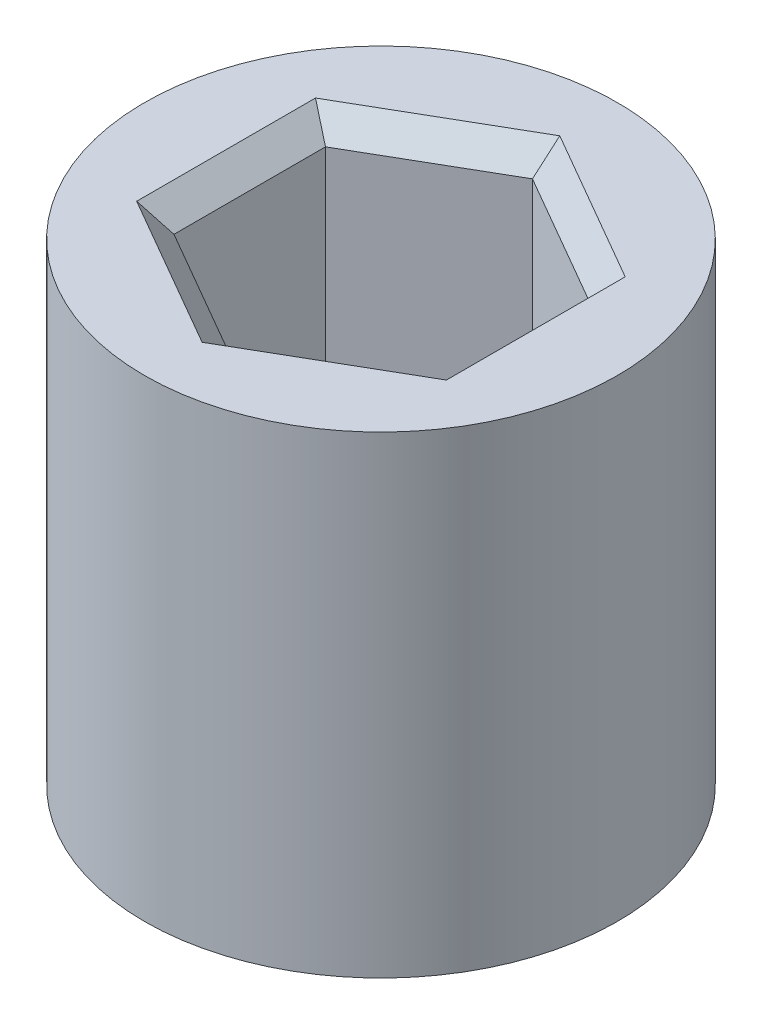
ISO-10303-21;
HEADER;
FILE_DESCRIPTION(('STEP AP214'),'2;1');
FILE_NAME('part.step','',(''),(''),'','','');
FILE_SCHEMA(('AUTOMOTIVE_DESIGN { 1 0 10303 214 1 1 1 1 }'));
ENDSEC;
DATA;
#1=APPLICATION_CONTEXT('core data for automotive mechanical design processes');
#2=APPLICATION_PROTOCOL_DEFINITION('international standard','automotive_design',2000,#1);
#3=PRODUCT_CONTEXT('',#1,'mechanical');
#4=PRODUCT('Part','Part','',(#3));
#5=PRODUCT_RELATED_PRODUCT_CATEGORY('part','',(#4));
#6=PRODUCT_DEFINITION_FORMATION('','',#4);
#7=PRODUCT_DEFINITION_CONTEXT('part definition',#1,'design');
#8=PRODUCT_DEFINITION('design','',#6,#7);
#9=PRODUCT_DEFINITION_SHAPE('','',#8);
#10=(LENGTH_UNIT() NAMED_UNIT(*) SI_UNIT(.MILLI.,.METRE.));
#11=(NAMED_UNIT(*) PLANE_ANGLE_UNIT() SI_UNIT($,.RADIAN.));
#12=(NAMED_UNIT(*) SI_UNIT($,.STERADIAN.) SOLID_ANGLE_UNIT());
#13=UNCERTAINTY_MEASURE_WITH_UNIT(LENGTH_MEASURE(1.E-05),#10,'distance_accuracy_value','');
#14=(GEOMETRIC_REPRESENTATION_CONTEXT(3) GLOBAL_UNCERTAINTY_ASSIGNED_CONTEXT((#13)) GLOBAL_UNIT_ASSIGNED_CONTEXT((#10,
#11,#12)) REPRESENTATION_CONTEXT('',''));
#15=CARTESIAN_POINT('',(0.,0.,0.));
#16=DIRECTION('',(0.,0.,1.));
#17=DIRECTION('',(1.,0.,0.));
#18=AXIS2_PLACEMENT_3D('',#15,#16,#17);
#19=CARTESIAN_POINT('',(0.,10.,0.));
#20=DIRECTION('',(0.,-1.,0.));
#21=DIRECTION('',(0.,0.,-1.));
#22=AXIS2_PLACEMENT_3D('',#19,#20,#21);
#23=CYLINDRICAL_SURFACE('',#22,5.);
#24=CARTESIAN_POINT('',(0.,10.,0.));
#25=DIRECTION('',(0.,1.,0.));
#26=DIRECTION('',(0.,0.,1.));
#27=AXIS2_PLACEMENT_3D('',#24,#25,#26);
#28=CIRCLE('',#27,5.);
#29=CARTESIAN_POINT('',(0.,10.,5.));
#30=VERTEX_POINT('',#29);
#31=EDGE_CURVE('E180',#30,#30,#28,.T.);
#32=ORIENTED_EDGE('',*,*,#31,.F.);
#33=EDGE_LOOP('',(#32));
#34=FACE_BOUND('',#33,.T.);
#35=CARTESIAN_POINT('',(0.,0.,0.));
#36=DIRECTION('',(0.,1.,0.));
#37=DIRECTION('',(0.,0.,1.));
#38=AXIS2_PLACEMENT_3D('',#35,#36,#37);
#39=CIRCLE('',#38,5.);
#40=CARTESIAN_POINT('',(0.,0.,5.));
#41=VERTEX_POINT('',#40);
#42=EDGE_CURVE('E166',#41,#41,#39,.T.);
#43=ORIENTED_EDGE('',*,*,#42,.T.);
#44=EDGE_LOOP('',(#43));
#45=FACE_BOUND('',#44,.T.);
#46=ADVANCED_FACE('F49',(#34,#45),#23,.T.);
#47=CARTESIAN_POINT('',(0.,10.,0.));
#48=DIRECTION('',(0.,1.,0.));
#49=DIRECTION('',(0.,0.,1.));
#50=AXIS2_PLACEMENT_3D('',#47,#48,#49);
#51=PLANE('',#50);
#52=DIRECTION('',(0.,0.,1.));
#53=VECTOR('',#52,1.);
#54=CARTESIAN_POINT('',(3.275,10.,1.60214699700121));
#55=LINE('',#54,#53);
#56=CARTESIAN_POINT('',(3.275,10.,-1.89082213159603));
#57=VERTEX_POINT('',#56);
#58=CARTESIAN_POINT('',(3.275,10.,1.89082213159602));
#59=VERTEX_POINT('',#58);
#60=EDGE_CURVE('E203',#57,#59,#55,.T.);
#61=ORIENTED_EDGE('',*,*,#60,.T.);
#62=DIRECTION('',(-0.866025403784439,0.,0.5));
#63=VECTOR('',#62,1.);
#64=CARTESIAN_POINT('',(0.250000000000001,10.,3.63730669589464));
#65=LINE('',#64,#63);
#66=CARTESIAN_POINT('',(0.,10.,3.78164426319205));
#67=VERTEX_POINT('',#66);
#68=EDGE_CURVE('E206',#59,#67,#65,.T.);
#69=ORIENTED_EDGE('',*,*,#68,.T.);
#70=DIRECTION('',(-0.866025403784439,0.,-0.5));
#71=VECTOR('',#70,1.);
#72=CARTESIAN_POINT('',(-3.025,10.,2.03515969889343));
#73=LINE('',#72,#71);
#74=CARTESIAN_POINT('',(-3.275,10.,1.89082213159603));
#75=VERTEX_POINT('',#74);
#76=EDGE_CURVE('E194',#67,#75,#73,.T.);
#77=ORIENTED_EDGE('',*,*,#76,.T.);
#78=DIRECTION('',(0.,0.,-1.));
#79=VECTOR('',#78,1.);
#80=CARTESIAN_POINT('',(-3.275,10.,-1.60214699700121));
#81=LINE('',#80,#79);
#82=CARTESIAN_POINT('',(-3.275,10.,-1.89082213159602));
#83=VERTEX_POINT('',#82);
#84=EDGE_CURVE('E191',#75,#83,#81,.T.);
#85=ORIENTED_EDGE('',*,*,#84,.T.);
#86=DIRECTION('',(0.866025403784439,0.,-0.5));
#87=VECTOR('',#86,1.);
#88=CARTESIAN_POINT('',(-0.250000000000001,10.,-3.63730669589464));
#89=LINE('',#88,#87);
#90=CARTESIAN_POINT('',(0.,10.,-3.78164426319205));
#91=VERTEX_POINT('',#90);
#92=EDGE_CURVE('E197',#83,#91,#89,.T.);
#93=ORIENTED_EDGE('',*,*,#92,.T.);
#94=DIRECTION('',(0.866025403784439,0.,0.5));
#95=VECTOR('',#94,1.);
#96=CARTESIAN_POINT('',(3.025,10.,-2.03515969889343));
#97=LINE('',#96,#95);
#98=EDGE_CURVE('E200',#91,#57,#97,.T.);
#99=ORIENTED_EDGE('',*,*,#98,.T.);
#100=EDGE_LOOP('',(#61,#69,#77,#85,#93,#99));
#101=FACE_BOUND('',#100,.T.);
#102=ORIENTED_EDGE('',*,*,#31,.T.);
#103=EDGE_LOOP('',(#102));
#104=FACE_BOUND('',#103,.T.);
#105=ADVANCED_FACE('F274',(#101,#104),#51,.T.);
#106=CARTESIAN_POINT('',(0.,0.,0.));
#107=DIRECTION('',(0.,1.,0.));
#108=DIRECTION('',(0.,0.,1.));
#109=AXIS2_PLACEMENT_3D('',#106,#107,#108);
#110=PLANE('',#109);
#111=ORIENTED_EDGE('',*,*,#42,.F.);
#112=EDGE_LOOP('',(#111));
#113=FACE_BOUND('',#112,.T.);
#114=ADVANCED_FACE('F270',(#113),#110,.F.);
#115=CARTESIAN_POINT('',(-2.775,3.4,-1.60214699700121));
#116=DIRECTION('',(-1.,0.,0.));
#117=DIRECTION('',(0.,0.,1.));
#118=AXIS2_PLACEMENT_3D('',#115,#116,#117);
#119=PLANE('',#118);
#120=DIRECTION('',(0.,1.,0.));
#121=VECTOR('',#120,1.);
#122=CARTESIAN_POINT('',(-2.775,3.4,-1.60214699700121));
#123=LINE('',#122,#121);
#124=CARTESIAN_POINT('',(-2.775,3.4,-1.60214699700121));
#125=VERTEX_POINT('',#124);
#126=CARTESIAN_POINT('',(-2.775,9.5,-1.60214699700121));
#127=VERTEX_POINT('',#126);
#128=EDGE_CURVE('E163',#125,#127,#123,.T.);
#129=ORIENTED_EDGE('',*,*,#128,.T.);
#130=DIRECTION('',(0.,0.,1.));
#131=VECTOR('',#130,1.);
#132=CARTESIAN_POINT('',(-2.775,9.5,1.60214699700121));
#133=LINE('',#132,#131);
#134=CARTESIAN_POINT('',(-2.775,9.5,1.60214699700121));
#135=VERTEX_POINT('',#134);
#136=EDGE_CURVE('E11',#127,#135,#133,.T.);
#137=ORIENTED_EDGE('',*,*,#136,.T.);
#138=DIRECTION('',(0.,1.,0.));
#139=VECTOR('',#138,1.);
#140=CARTESIAN_POINT('',(-2.775,3.4,1.60214699700121));
#141=LINE('',#140,#139);
#142=CARTESIAN_POINT('',(-2.775,3.4,1.60214699700121));
#143=VERTEX_POINT('',#142);
#144=EDGE_CURVE('E121',#143,#135,#141,.T.);
#145=ORIENTED_EDGE('',*,*,#144,.F.);
#146=DIRECTION('',(0.,0.,1.));
#147=VECTOR('',#146,1.);
#148=CARTESIAN_POINT('',(-2.775,3.4,-1.60214699700121));
#149=LINE('',#148,#147);
#150=EDGE_CURVE('E125',#125,#143,#149,.T.);
#151=ORIENTED_EDGE('',*,*,#150,.F.);
#152=EDGE_LOOP('',(#129,#137,#145,#151));
#153=FACE_BOUND('',#152,.T.);
#154=ADVANCED_FACE('F123',(#153),#119,.F.);
#155=CARTESIAN_POINT('',(0.,3.4,-3.20429399400242));
#156=DIRECTION('',(-0.5,0.,-0.866025403784438));
#157=DIRECTION('',(-0.866025403784439,0.,0.5));
#158=AXIS2_PLACEMENT_3D('',#155,#156,#157);
#159=PLANE('',#158);
#160=DIRECTION('',(0.,1.,0.));
#161=VECTOR('',#160,1.);
#162=CARTESIAN_POINT('',(0.,3.4,-3.20429399400242));
#163=LINE('',#162,#161);
#164=CARTESIAN_POINT('',(0.,3.4,-3.20429399400242));
#165=VERTEX_POINT('',#164);
#166=CARTESIAN_POINT('',(0.,9.5,-3.20429399400242));
#167=VERTEX_POINT('',#166);
#168=EDGE_CURVE('E167',#165,#167,#163,.T.);
#169=ORIENTED_EDGE('',*,*,#168,.T.);
#170=DIRECTION('',(-0.866025403784439,0.,0.5));
#171=VECTOR('',#170,1.);
#172=CARTESIAN_POINT('',(-2.775,9.5,-1.60214699700121));
#173=LINE('',#172,#171);
#174=EDGE_CURVE('E74',#167,#127,#173,.T.);
#175=ORIENTED_EDGE('',*,*,#174,.T.);
#176=ORIENTED_EDGE('',*,*,#128,.F.);
#177=DIRECTION('',(-0.866025403784439,0.,0.5));
#178=VECTOR('',#177,1.);
#179=CARTESIAN_POINT('',(0.,3.4,-3.20429399400242));
#180=LINE('',#179,#178);
#181=EDGE_CURVE('E131',#165,#125,#180,.T.);
#182=ORIENTED_EDGE('',*,*,#181,.F.);
#183=EDGE_LOOP('',(#169,#175,#176,#182));
#184=FACE_BOUND('',#183,.T.);
#185=ADVANCED_FACE('F262',(#184),#159,.F.);
#186=CARTESIAN_POINT('',(2.775,3.4,-1.60214699700121));
#187=DIRECTION('',(0.5,0.,-0.866025403784439));
#188=DIRECTION('',(-0.866025403784438,0.,-0.5));
#189=AXIS2_PLACEMENT_3D('',#186,#187,#188);
#190=PLANE('',#189);
#191=DIRECTION('',(0.,1.,0.));
#192=VECTOR('',#191,1.);
#193=CARTESIAN_POINT('',(2.775,3.4,-1.60214699700121));
#194=LINE('',#193,#192);
#195=CARTESIAN_POINT('',(2.775,3.4,-1.60214699700121));
#196=VERTEX_POINT('',#195);
#197=CARTESIAN_POINT('',(2.775,9.5,-1.60214699700121));
#198=VERTEX_POINT('',#197);
#199=EDGE_CURVE('E170',#196,#198,#194,.T.);
#200=ORIENTED_EDGE('',*,*,#199,.T.);
#201=DIRECTION('',(-0.866025403784438,0.,-0.5));
#202=VECTOR('',#201,1.);
#203=CARTESIAN_POINT('',(0.,9.5,-3.20429399400242));
#204=LINE('',#203,#202);
#205=EDGE_CURVE('E213',#198,#167,#204,.T.);
#206=ORIENTED_EDGE('',*,*,#205,.T.);
#207=ORIENTED_EDGE('',*,*,#168,.F.);
#208=DIRECTION('',(-0.866025403784439,0.,-0.5));
#209=VECTOR('',#208,1.);
#210=CARTESIAN_POINT('',(2.775,3.4,-1.60214699700121));
#211=LINE('',#210,#209);
#212=EDGE_CURVE('E158',#196,#165,#211,.T.);
#213=ORIENTED_EDGE('',*,*,#212,.F.);
#214=EDGE_LOOP('',(#200,#206,#207,#213));
#215=FACE_BOUND('',#214,.T.);
#216=ADVANCED_FACE('F261',(#215),#190,.F.);
#217=CARTESIAN_POINT('',(2.775,3.4,1.60214699700121));
#218=DIRECTION('',(1.,0.,0.));
#219=DIRECTION('',(0.,0.,-1.));
#220=AXIS2_PLACEMENT_3D('',#217,#218,#219);
#221=PLANE('',#220);
#222=DIRECTION('',(0.,1.,0.));
#223=VECTOR('',#222,1.);
#224=CARTESIAN_POINT('',(2.775,3.4,1.60214699700121));
#225=LINE('',#224,#223);
#226=CARTESIAN_POINT('',(2.775,3.4,1.60214699700121));
#227=VERTEX_POINT('',#226);
#228=CARTESIAN_POINT('',(2.775,9.5,1.60214699700121));
#229=VERTEX_POINT('',#228);
#230=EDGE_CURVE('E174',#227,#229,#225,.T.);
#231=ORIENTED_EDGE('',*,*,#230,.T.);
#232=DIRECTION('',(0.,0.,-1.));
#233=VECTOR('',#232,1.);
#234=CARTESIAN_POINT('',(2.775,9.5,-1.60214699700121));
#235=LINE('',#234,#233);
#236=EDGE_CURVE('E210',#229,#198,#235,.T.);
#237=ORIENTED_EDGE('',*,*,#236,.T.);
#238=ORIENTED_EDGE('',*,*,#199,.F.);
#239=DIRECTION('',(0.,0.,-1.));
#240=VECTOR('',#239,1.);
#241=CARTESIAN_POINT('',(2.775,3.4,1.60214699700121));
#242=LINE('',#241,#240);
#243=EDGE_CURVE('E154',#227,#196,#242,.T.);
#244=ORIENTED_EDGE('',*,*,#243,.F.);
#245=EDGE_LOOP('',(#231,#237,#238,#244));
#246=FACE_BOUND('',#245,.T.);
#247=ADVANCED_FACE('F258',(#246),#221,.F.);
#248=CARTESIAN_POINT('',(0.,3.4,3.20429399400242));
#249=DIRECTION('',(0.5,0.,0.866025403784438));
#250=DIRECTION('',(0.866025403784439,0.,-0.5));
#251=AXIS2_PLACEMENT_3D('',#248,#249,#250);
#252=PLANE('',#251);
#253=DIRECTION('',(0.,1.,0.));
#254=VECTOR('',#253,1.);
#255=CARTESIAN_POINT('',(0.,3.4,3.20429399400242));
#256=LINE('',#255,#254);
#257=CARTESIAN_POINT('',(0.,3.4,3.20429399400242));
#258=VERTEX_POINT('',#257);
#259=CARTESIAN_POINT('',(0.,9.5,3.20429399400242));
#260=VERTEX_POINT('',#259);
#261=EDGE_CURVE('E130',#258,#260,#256,.T.);
#262=ORIENTED_EDGE('',*,*,#261,.T.);
#263=DIRECTION('',(0.866025403784439,0.,-0.5));
#264=VECTOR('',#263,1.);
#265=CARTESIAN_POINT('',(2.775,9.5,1.60214699700121));
#266=LINE('',#265,#264);
#267=EDGE_CURVE('E184',#260,#229,#266,.T.);
#268=ORIENTED_EDGE('',*,*,#267,.T.);
#269=ORIENTED_EDGE('',*,*,#230,.F.);
#270=DIRECTION('',(0.866025403784438,0.,-0.5));
#271=VECTOR('',#270,1.);
#272=CARTESIAN_POINT('',(0.,3.4,3.20429399400242));
#273=LINE('',#272,#271);
#274=EDGE_CURVE('E141',#258,#227,#273,.T.);
#275=ORIENTED_EDGE('',*,*,#274,.F.);
#276=EDGE_LOOP('',(#262,#268,#269,#275));
#277=FACE_BOUND('',#276,.T.);
#278=ADVANCED_FACE('F254',(#277),#252,.F.);
#279=CARTESIAN_POINT('',(-2.775,3.4,1.60214699700121));
#280=DIRECTION('',(-0.5,0.,0.866025403784439));
#281=DIRECTION('',(0.866025403784439,0.,0.5));
#282=AXIS2_PLACEMENT_3D('',#279,#280,#281);
#283=PLANE('',#282);
#284=ORIENTED_EDGE('',*,*,#144,.T.);
#285=DIRECTION('',(0.866025403784439,0.,0.5));
#286=VECTOR('',#285,1.);
#287=CARTESIAN_POINT('',(0.,9.5,3.20429399400242));
#288=LINE('',#287,#286);
#289=EDGE_CURVE('E60',#135,#260,#288,.T.);
#290=ORIENTED_EDGE('',*,*,#289,.T.);
#291=ORIENTED_EDGE('',*,*,#261,.F.);
#292=DIRECTION('',(0.866025403784439,0.,0.5));
#293=VECTOR('',#292,1.);
#294=CARTESIAN_POINT('',(-2.775,3.4,1.60214699700121));
#295=LINE('',#294,#293);
#296=EDGE_CURVE('E134',#143,#258,#295,.T.);
#297=ORIENTED_EDGE('',*,*,#296,.F.);
#298=EDGE_LOOP('',(#284,#290,#291,#297));
#299=FACE_BOUND('',#298,.T.);
#300=ADVANCED_FACE('F135',(#299),#283,.F.);
#301=CARTESIAN_POINT('',(0.,3.4,0.));
#302=DIRECTION('',(0.,1.,0.));
#303=DIRECTION('',(0.,0.,1.));
#304=AXIS2_PLACEMENT_3D('',#301,#302,#303);
#305=PLANE('',#304);
#306=ORIENTED_EDGE('',*,*,#150,.T.);
#307=ORIENTED_EDGE('',*,*,#296,.T.);
#308=ORIENTED_EDGE('',*,*,#274,.T.);
#309=ORIENTED_EDGE('',*,*,#243,.T.);
#310=ORIENTED_EDGE('',*,*,#212,.T.);
#311=ORIENTED_EDGE('',*,*,#181,.T.);
#312=EDGE_LOOP('',(#306,#307,#308,#309,#310,#311));
#313=FACE_BOUND('',#312,.T.);
#314=ADVANCED_FACE('F143',(#313),#305,.T.);
#315=CARTESIAN_POINT('',(0.,9.5,-3.20429399400242));
#316=DIRECTION('',(0.353553390593273,0.70710678118655,0.612372435695792));
#317=DIRECTION('',(0.866025403784439,0.,-0.5));
#318=AXIS2_PLACEMENT_3D('',#315,#316,#317);
#319=PLANE('',#318);
#320=DIRECTION('',(0.,0.654653670707974,-0.755928946018457));
#321=VECTOR('',#320,1.);
#322=CARTESIAN_POINT('',(0.,8.70714285714286,-2.28878142428744));
#323=LINE('',#322,#321);
#324=EDGE_CURVE('E150',#91,#167,#323,.F.);
#325=ORIENTED_EDGE('',*,*,#324,.F.);
#326=ORIENTED_EDGE('',*,*,#92,.F.);
#327=DIRECTION('',(-0.654653670707979,0.654653670707975,-0.377964473009228));
#328=VECTOR('',#327,1.);
#329=CARTESIAN_POINT('',(-1.98214285714285,8.70714285714286,-1.14439071214372));
#330=LINE('',#329,#328);
#331=EDGE_CURVE('E54',#127,#83,#330,.T.);
#332=ORIENTED_EDGE('',*,*,#331,.F.);
#333=ORIENTED_EDGE('',*,*,#174,.F.);
#334=EDGE_LOOP('',(#325,#326,#332,#333));
#335=FACE_BOUND('',#334,.T.);
#336=ADVANCED_FACE('F52',(#335),#319,.T.);
#337=CARTESIAN_POINT('',(-2.775,9.5,-1.60214699700121));
#338=DIRECTION('',(0.707106781186545,0.70710678118655,0.));
#339=DIRECTION('',(0.,0.,-1.));
#340=AXIS2_PLACEMENT_3D('',#337,#338,#339);
#341=PLANE('',#340);
#342=ORIENTED_EDGE('',*,*,#331,.T.);
#343=ORIENTED_EDGE('',*,*,#84,.F.);
#344=DIRECTION('',(0.654653670707979,-0.654653670707974,-0.377964473009228));
#345=VECTOR('',#344,1.);
#346=CARTESIAN_POINT('',(-2.775,9.5,1.60214699700121));
#347=LINE('',#346,#345);
#348=EDGE_CURVE('E230',#135,#75,#347,.F.);
#349=ORIENTED_EDGE('',*,*,#348,.F.);
#350=ORIENTED_EDGE('',*,*,#136,.F.);
#351=EDGE_LOOP('',(#342,#343,#349,#350));
#352=FACE_BOUND('',#351,.T.);
#353=ADVANCED_FACE('F246',(#352),#341,.T.);
#354=CARTESIAN_POINT('',(2.775,9.5,-1.60214699700121));
#355=DIRECTION('',(-0.353553390593272,0.70710678118655,0.612372435695792));
#356=DIRECTION('',(0.866025403784438,0.,0.5));
#357=AXIS2_PLACEMENT_3D('',#354,#355,#356);
#358=PLANE('',#357);
#359=ORIENTED_EDGE('',*,*,#324,.T.);
#360=ORIENTED_EDGE('',*,*,#205,.F.);
#361=DIRECTION('',(0.654653670707979,0.654653670707974,-0.377964473009229));
#362=VECTOR('',#361,1.);
#363=CARTESIAN_POINT('',(1.98214285714285,8.70714285714286,-1.14439071214372));
#364=LINE('',#363,#362);
#365=EDGE_CURVE('E226',#57,#198,#364,.F.);
#366=ORIENTED_EDGE('',*,*,#365,.F.);
#367=ORIENTED_EDGE('',*,*,#98,.F.);
#368=EDGE_LOOP('',(#359,#360,#366,#367));
#369=FACE_BOUND('',#368,.T.);
#370=ADVANCED_FACE('F239',(#369),#358,.T.);
#371=CARTESIAN_POINT('',(-2.775,9.5,1.60214699700121));
#372=DIRECTION('',(0.353553390593272,0.70710678118655,-0.612372435695792));
#373=DIRECTION('',(-0.866025403784439,0.,-0.5));
#374=AXIS2_PLACEMENT_3D('',#371,#372,#373);
#375=PLANE('',#374);
#376=ORIENTED_EDGE('',*,*,#348,.T.);
#377=ORIENTED_EDGE('',*,*,#76,.F.);
#378=DIRECTION('',(0.,-0.654653670707974,-0.755928946018457));
#379=VECTOR('',#378,1.);
#380=CARTESIAN_POINT('',(0.,9.5,3.20429399400242));
#381=LINE('',#380,#379);
#382=EDGE_CURVE('E223',#260,#67,#381,.F.);
#383=ORIENTED_EDGE('',*,*,#382,.F.);
#384=ORIENTED_EDGE('',*,*,#289,.F.);
#385=EDGE_LOOP('',(#376,#377,#383,#384));
#386=FACE_BOUND('',#385,.T.);
#387=ADVANCED_FACE('F251',(#386),#375,.T.);
#388=CARTESIAN_POINT('',(2.775,9.5,1.60214699700121));
#389=DIRECTION('',(-0.707106781186545,0.70710678118655,0.));
#390=DIRECTION('',(0.,0.,1.));
#391=AXIS2_PLACEMENT_3D('',#388,#389,#390);
#392=PLANE('',#391);
#393=ORIENTED_EDGE('',*,*,#365,.T.);
#394=ORIENTED_EDGE('',*,*,#236,.F.);
#395=DIRECTION('',(0.654653670707979,0.654653670707975,0.377964473009228));
#396=VECTOR('',#395,1.);
#397=CARTESIAN_POINT('',(1.98214285714285,8.70714285714286,1.14439071214372));
#398=LINE('',#397,#396);
#399=EDGE_CURVE('E220',#59,#229,#398,.F.);
#400=ORIENTED_EDGE('',*,*,#399,.F.);
#401=ORIENTED_EDGE('',*,*,#60,.F.);
#402=EDGE_LOOP('',(#393,#394,#400,#401));
#403=FACE_BOUND('',#402,.T.);
#404=ADVANCED_FACE('F294',(#403),#392,.T.);
#405=CARTESIAN_POINT('',(0.,9.5,3.20429399400242));
#406=DIRECTION('',(-0.353553390593273,0.70710678118655,-0.612372435695792));
#407=DIRECTION('',(-0.866025403784439,0.,0.5));
#408=AXIS2_PLACEMENT_3D('',#405,#406,#407);
#409=PLANE('',#408);
#410=ORIENTED_EDGE('',*,*,#382,.T.);
#411=ORIENTED_EDGE('',*,*,#68,.F.);
#412=ORIENTED_EDGE('',*,*,#399,.T.);
#413=ORIENTED_EDGE('',*,*,#267,.F.);
#414=EDGE_LOOP('',(#410,#411,#412,#413));
#415=FACE_BOUND('',#414,.T.);
#416=ADVANCED_FACE('F288',(#415),#409,.T.);
#417=CLOSED_SHELL('',(#46,#105,#114,#154,#185,#216,#247,#278,#300,#314,#336,#353,#370,#387,#404,#416));
#418=MANIFOLD_SOLID_BREP('B2',#417);
#419=ADVANCED_BREP_SHAPE_REPRESENTATION('',(#18,#418),#14);
#420=SHAPE_DEFINITION_REPRESENTATION(#9,#419);
ENDSEC;
END-ISO-10303-21;
